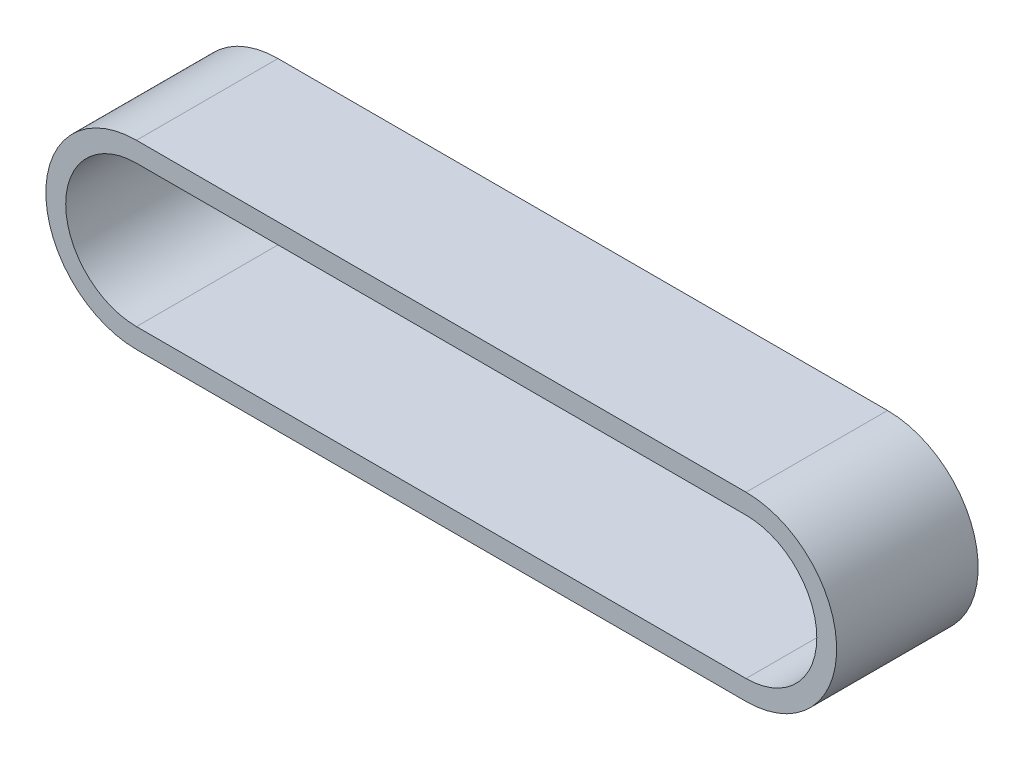
ISO-10303-21;
HEADER;
FILE_DESCRIPTION(('STEP AP214'),'2;1');
FILE_NAME('part.step','',(''),(''),'','','');
FILE_SCHEMA(('AUTOMOTIVE_DESIGN { 1 0 10303 214 1 1 1 1 }'));
ENDSEC;
DATA;
#1=APPLICATION_CONTEXT('core data for automotive mechanical design processes');
#2=APPLICATION_PROTOCOL_DEFINITION('international standard','automotive_design',2000,#1);
#3=PRODUCT_CONTEXT('',#1,'mechanical');
#4=PRODUCT('Part','Part','',(#3));
#5=PRODUCT_RELATED_PRODUCT_CATEGORY('part','',(#4));
#6=PRODUCT_DEFINITION_FORMATION('','',#4);
#7=PRODUCT_DEFINITION_CONTEXT('part definition',#1,'design');
#8=PRODUCT_DEFINITION('design','',#6,#7);
#9=PRODUCT_DEFINITION_SHAPE('','',#8);
#10=(LENGTH_UNIT() NAMED_UNIT(*) SI_UNIT(.MILLI.,.METRE.));
#11=(NAMED_UNIT(*) PLANE_ANGLE_UNIT() SI_UNIT($,.RADIAN.));
#12=(NAMED_UNIT(*) SI_UNIT($,.STERADIAN.) SOLID_ANGLE_UNIT());
#13=UNCERTAINTY_MEASURE_WITH_UNIT(LENGTH_MEASURE(1.E-05),#10,'distance_accuracy_value','');
#14=(GEOMETRIC_REPRESENTATION_CONTEXT(3) GLOBAL_UNCERTAINTY_ASSIGNED_CONTEXT((#13)) GLOBAL_UNIT_ASSIGNED_CONTEXT((#10,
#11,#12)) REPRESENTATION_CONTEXT('',''));
#15=CARTESIAN_POINT('',(0.,0.,0.));
#16=DIRECTION('',(0.,0.,1.));
#17=DIRECTION('',(1.,0.,0.));
#18=AXIS2_PLACEMENT_3D('',#15,#16,#17);
#19=CARTESIAN_POINT('',(107.682833186459,-12.5,25.));
#20=DIRECTION('',(0.,0.,-1.));
#21=DIRECTION('',(-1.,0.,0.));
#22=AXIS2_PLACEMENT_3D('',#19,#20,#21);
#23=PLANE('',#22);
#24=CARTESIAN_POINT('',(107.682833186459,-12.5,25.));
#25=DIRECTION('',(0.,0.,1.));
#26=DIRECTION('',(-1.,0.,0.));
#27=AXIS2_PLACEMENT_3D('',#24,#25,#26);
#28=CIRCLE('',#27,16.0090236418639);
#29=CARTESIAN_POINT('',(107.682833186459,-28.5090236418639,25.));
#30=VERTEX_POINT('',#29);
#31=CARTESIAN_POINT('',(107.682833186459,3.50902364186389,25.));
#32=VERTEX_POINT('',#31);
#33=EDGE_CURVE('E153',#30,#32,#28,.T.);
#34=ORIENTED_EDGE('',*,*,#33,.T.);
#35=DIRECTION('',(-1.,0.,0.));
#36=VECTOR('',#35,1.);
#37=CARTESIAN_POINT('',(0.,3.50902364186389,25.));
#38=LINE('',#37,#36);
#39=CARTESIAN_POINT('',(0.,3.50902364186389,25.));
#40=VERTEX_POINT('',#39);
#41=EDGE_CURVE('E157',#32,#40,#38,.T.);
#42=ORIENTED_EDGE('',*,*,#41,.T.);
#43=CARTESIAN_POINT('',(0.,-12.5,25.));
#44=DIRECTION('',(0.,0.,1.));
#45=DIRECTION('',(1.,0.,0.));
#46=AXIS2_PLACEMENT_3D('',#43,#44,#45);
#47=CIRCLE('',#46,16.0090236418639);
#48=CARTESIAN_POINT('',(0.,-28.5090236418639,25.));
#49=VERTEX_POINT('',#48);
#50=EDGE_CURVE('E161',#40,#49,#47,.T.);
#51=ORIENTED_EDGE('',*,*,#50,.T.);
#52=DIRECTION('',(1.,0.,0.));
#53=VECTOR('',#52,1.);
#54=CARTESIAN_POINT('',(0.,-28.5090236418639,25.));
#55=LINE('',#54,#53);
#56=EDGE_CURVE('E164',#49,#30,#55,.T.);
#57=ORIENTED_EDGE('',*,*,#56,.T.);
#58=EDGE_LOOP('',(#34,#42,#51,#57));
#59=FACE_BOUND('',#58,.T.);
#60=CARTESIAN_POINT('',(0.,-12.5,25.));
#61=DIRECTION('',(0.,0.,1.));
#62=DIRECTION('',(1.,0.,0.));
#63=AXIS2_PLACEMENT_3D('',#60,#61,#62);
#64=CIRCLE('',#63,12.5);
#65=CARTESIAN_POINT('',(0.,0.,25.));
#66=VERTEX_POINT('',#65);
#67=CARTESIAN_POINT('',(0.,-25.,25.));
#68=VERTEX_POINT('',#67);
#69=EDGE_CURVE('E105',#66,#68,#64,.T.);
#70=ORIENTED_EDGE('',*,*,#69,.F.);
#71=DIRECTION('',(-1.,0.,0.));
#72=VECTOR('',#71,1.);
#73=CARTESIAN_POINT('',(0.,0.,25.));
#74=LINE('',#73,#72);
#75=CARTESIAN_POINT('',(107.682833186459,0.,25.));
#76=VERTEX_POINT('',#75);
#77=EDGE_CURVE('E131',#76,#66,#74,.T.);
#78=ORIENTED_EDGE('',*,*,#77,.F.);
#79=CARTESIAN_POINT('',(107.682833186459,-12.5,25.));
#80=DIRECTION('',(0.,0.,1.));
#81=DIRECTION('',(-1.,0.,0.));
#82=AXIS2_PLACEMENT_3D('',#79,#80,#81);
#83=CIRCLE('',#82,12.5);
#84=CARTESIAN_POINT('',(107.682833186459,-25.,25.));
#85=VERTEX_POINT('',#84);
#86=EDGE_CURVE('E127',#85,#76,#83,.T.);
#87=ORIENTED_EDGE('',*,*,#86,.F.);
#88=DIRECTION('',(1.,0.,0.));
#89=VECTOR('',#88,1.);
#90=CARTESIAN_POINT('',(0.,-25.,25.));
#91=LINE('',#90,#89);
#92=EDGE_CURVE('E114',#68,#85,#91,.T.);
#93=ORIENTED_EDGE('',*,*,#92,.F.);
#94=EDGE_LOOP('',(#70,#78,#87,#93));
#95=FACE_BOUND('',#94,.T.);
#96=ADVANCED_FACE('F39',(#59,#95),#23,.F.);
#97=CARTESIAN_POINT('',(107.682833186459,-12.5,0.));
#98=DIRECTION('',(0.,0.,-1.));
#99=DIRECTION('',(-1.,0.,0.));
#100=AXIS2_PLACEMENT_3D('',#97,#98,#99);
#101=PLANE('',#100);
#102=CARTESIAN_POINT('',(107.682833186459,-12.5,0.));
#103=DIRECTION('',(0.,0.,1.));
#104=DIRECTION('',(-1.,0.,0.));
#105=AXIS2_PLACEMENT_3D('',#102,#103,#104);
#106=CIRCLE('',#105,16.0090236418639);
#107=CARTESIAN_POINT('',(107.682833186459,-28.5090236418639,0.));
#108=VERTEX_POINT('',#107);
#109=CARTESIAN_POINT('',(107.682833186459,3.50902364186389,0.));
#110=VERTEX_POINT('',#109);
#111=EDGE_CURVE('E123',#108,#110,#106,.T.);
#112=ORIENTED_EDGE('',*,*,#111,.F.);
#113=DIRECTION('',(1.,0.,0.));
#114=VECTOR('',#113,1.);
#115=CARTESIAN_POINT('',(0.,-28.5090236418639,0.));
#116=LINE('',#115,#114);
#117=CARTESIAN_POINT('',(0.,-28.5090236418639,0.));
#118=VERTEX_POINT('',#117);
#119=EDGE_CURVE('E158',#118,#108,#116,.T.);
#120=ORIENTED_EDGE('',*,*,#119,.F.);
#121=CARTESIAN_POINT('',(0.,-12.5,0.));
#122=DIRECTION('',(0.,0.,1.));
#123=DIRECTION('',(1.,0.,0.));
#124=AXIS2_PLACEMENT_3D('',#121,#122,#123);
#125=CIRCLE('',#124,16.0090236418639);
#126=CARTESIAN_POINT('',(0.,3.50902364186389,0.));
#127=VERTEX_POINT('',#126);
#128=EDGE_CURVE('E174',#127,#118,#125,.T.);
#129=ORIENTED_EDGE('',*,*,#128,.F.);
#130=DIRECTION('',(-1.,0.,0.));
#131=VECTOR('',#130,1.);
#132=CARTESIAN_POINT('',(0.,3.50902364186389,0.));
#133=LINE('',#132,#131);
#134=EDGE_CURVE('E171',#110,#127,#133,.T.);
#135=ORIENTED_EDGE('',*,*,#134,.F.);
#136=EDGE_LOOP('',(#112,#120,#129,#135));
#137=FACE_BOUND('',#136,.T.);
#138=DIRECTION('',(-1.,0.,0.));
#139=VECTOR('',#138,1.);
#140=CARTESIAN_POINT('',(0.,0.,0.));
#141=LINE('',#140,#139);
#142=CARTESIAN_POINT('',(107.682833186459,0.,0.));
#143=VERTEX_POINT('',#142);
#144=CARTESIAN_POINT('',(0.,0.,0.));
#145=VERTEX_POINT('',#144);
#146=EDGE_CURVE('E115',#143,#145,#141,.T.);
#147=ORIENTED_EDGE('',*,*,#146,.T.);
#148=CARTESIAN_POINT('',(0.,-12.5,0.));
#149=DIRECTION('',(0.,0.,1.));
#150=DIRECTION('',(1.,0.,0.));
#151=AXIS2_PLACEMENT_3D('',#148,#149,#150);
#152=CIRCLE('',#151,12.5);
#153=CARTESIAN_POINT('',(0.,-25.,0.));
#154=VERTEX_POINT('',#153);
#155=EDGE_CURVE('E63',#145,#154,#152,.T.);
#156=ORIENTED_EDGE('',*,*,#155,.T.);
#157=DIRECTION('',(1.,0.,0.));
#158=VECTOR('',#157,1.);
#159=CARTESIAN_POINT('',(0.,-25.,0.));
#160=LINE('',#159,#158);
#161=CARTESIAN_POINT('',(107.682833186459,-25.,0.));
#162=VERTEX_POINT('',#161);
#163=EDGE_CURVE('E121',#154,#162,#160,.T.);
#164=ORIENTED_EDGE('',*,*,#163,.T.);
#165=CARTESIAN_POINT('',(107.682833186459,-12.5,0.));
#166=DIRECTION('',(0.,0.,1.));
#167=DIRECTION('',(-1.,0.,0.));
#168=AXIS2_PLACEMENT_3D('',#165,#166,#167);
#169=CIRCLE('',#168,12.5);
#170=EDGE_CURVE('E140',#162,#143,#169,.T.);
#171=ORIENTED_EDGE('',*,*,#170,.T.);
#172=EDGE_LOOP('',(#147,#156,#164,#171));
#173=FACE_BOUND('',#172,.T.);
#174=ADVANCED_FACE('F197',(#137,#173),#101,.T.);
#175=CARTESIAN_POINT('',(107.682833186459,-12.5,25.));
#176=DIRECTION('',(0.,0.,-1.));
#177=DIRECTION('',(-1.,0.,0.));
#178=AXIS2_PLACEMENT_3D('',#175,#176,#177);
#179=CYLINDRICAL_SURFACE('',#178,16.0090236418639);
#180=ORIENTED_EDGE('',*,*,#111,.T.);
#181=DIRECTION('',(0.,0.,-1.));
#182=VECTOR('',#181,1.);
#183=CARTESIAN_POINT('',(107.682833186459,3.50902364186389,25.));
#184=LINE('',#183,#182);
#185=EDGE_CURVE('E11',#32,#110,#184,.T.);
#186=ORIENTED_EDGE('',*,*,#185,.F.);
#187=ORIENTED_EDGE('',*,*,#33,.F.);
#188=DIRECTION('',(0.,0.,-1.));
#189=VECTOR('',#188,1.);
#190=CARTESIAN_POINT('',(107.682833186459,-28.5090236418639,25.));
#191=LINE('',#190,#189);
#192=EDGE_CURVE('E167',#30,#108,#191,.T.);
#193=ORIENTED_EDGE('',*,*,#192,.T.);
#194=EDGE_LOOP('',(#180,#186,#187,#193));
#195=FACE_BOUND('',#194,.T.);
#196=ADVANCED_FACE('F41',(#195),#179,.T.);
#197=CARTESIAN_POINT('',(0.,3.50902364186389,25.));
#198=DIRECTION('',(0.,-1.,0.));
#199=DIRECTION('',(0.,0.,-1.));
#200=AXIS2_PLACEMENT_3D('',#197,#198,#199);
#201=PLANE('',#200);
#202=ORIENTED_EDGE('',*,*,#134,.T.);
#203=DIRECTION('',(0.,0.,-1.));
#204=VECTOR('',#203,1.);
#205=CARTESIAN_POINT('',(0.,3.50902364186389,25.));
#206=LINE('',#205,#204);
#207=EDGE_CURVE('E48',#40,#127,#206,.T.);
#208=ORIENTED_EDGE('',*,*,#207,.F.);
#209=ORIENTED_EDGE('',*,*,#41,.F.);
#210=ORIENTED_EDGE('',*,*,#185,.T.);
#211=EDGE_LOOP('',(#202,#208,#209,#210));
#212=FACE_BOUND('',#211,.T.);
#213=ADVANCED_FACE('F207',(#212),#201,.F.);
#214=CARTESIAN_POINT('',(0.,-12.5,25.));
#215=DIRECTION('',(0.,0.,-1.));
#216=DIRECTION('',(-1.,0.,0.));
#217=AXIS2_PLACEMENT_3D('',#214,#215,#216);
#218=CYLINDRICAL_SURFACE('',#217,16.0090236418639);
#219=ORIENTED_EDGE('',*,*,#128,.T.);
#220=DIRECTION('',(0.,0.,-1.));
#221=VECTOR('',#220,1.);
#222=CARTESIAN_POINT('',(0.,-28.5090236418639,25.));
#223=LINE('',#222,#221);
#224=EDGE_CURVE('E182',#49,#118,#223,.T.);
#225=ORIENTED_EDGE('',*,*,#224,.F.);
#226=ORIENTED_EDGE('',*,*,#50,.F.);
#227=ORIENTED_EDGE('',*,*,#207,.T.);
#228=EDGE_LOOP('',(#219,#225,#226,#227));
#229=FACE_BOUND('',#228,.T.);
#230=ADVANCED_FACE('F191',(#229),#218,.T.);
#231=CARTESIAN_POINT('',(0.,-28.5090236418639,25.));
#232=DIRECTION('',(0.,1.,0.));
#233=DIRECTION('',(0.,0.,1.));
#234=AXIS2_PLACEMENT_3D('',#231,#232,#233);
#235=PLANE('',#234);
#236=ORIENTED_EDGE('',*,*,#119,.T.);
#237=ORIENTED_EDGE('',*,*,#192,.F.);
#238=ORIENTED_EDGE('',*,*,#56,.F.);
#239=ORIENTED_EDGE('',*,*,#224,.T.);
#240=EDGE_LOOP('',(#236,#237,#238,#239));
#241=FACE_BOUND('',#240,.T.);
#242=ADVANCED_FACE('F201',(#241),#235,.F.);
#243=CARTESIAN_POINT('',(0.,-12.5,25.));
#244=DIRECTION('',(0.,0.,-1.));
#245=DIRECTION('',(-1.,0.,0.));
#246=AXIS2_PLACEMENT_3D('',#243,#244,#245);
#247=CYLINDRICAL_SURFACE('',#246,12.5);
#248=ORIENTED_EDGE('',*,*,#155,.F.);
#249=DIRECTION('',(0.,0.,-1.));
#250=VECTOR('',#249,1.);
#251=CARTESIAN_POINT('',(0.,0.,25.));
#252=LINE('',#251,#250);
#253=EDGE_CURVE('E109',#66,#145,#252,.T.);
#254=ORIENTED_EDGE('',*,*,#253,.F.);
#255=ORIENTED_EDGE('',*,*,#69,.T.);
#256=DIRECTION('',(0.,0.,-1.));
#257=VECTOR('',#256,1.);
#258=CARTESIAN_POINT('',(0.,-25.,25.));
#259=LINE('',#258,#257);
#260=EDGE_CURVE('E108',#68,#154,#259,.T.);
#261=ORIENTED_EDGE('',*,*,#260,.T.);
#262=EDGE_LOOP('',(#248,#254,#255,#261));
#263=FACE_BOUND('',#262,.T.);
#264=ADVANCED_FACE('F107',(#263),#247,.F.);
#265=CARTESIAN_POINT('',(0.,-25.,25.));
#266=DIRECTION('',(0.,1.,0.));
#267=DIRECTION('',(0.,0.,1.));
#268=AXIS2_PLACEMENT_3D('',#265,#266,#267);
#269=PLANE('',#268);
#270=ORIENTED_EDGE('',*,*,#163,.F.);
#271=ORIENTED_EDGE('',*,*,#260,.F.);
#272=ORIENTED_EDGE('',*,*,#92,.T.);
#273=DIRECTION('',(0.,0.,-1.));
#274=VECTOR('',#273,1.);
#275=CARTESIAN_POINT('',(107.682833186459,-25.,25.));
#276=LINE('',#275,#274);
#277=EDGE_CURVE('E124',#85,#162,#276,.T.);
#278=ORIENTED_EDGE('',*,*,#277,.T.);
#279=EDGE_LOOP('',(#270,#271,#272,#278));
#280=FACE_BOUND('',#279,.T.);
#281=ADVANCED_FACE('F118',(#280),#269,.T.);
#282=CARTESIAN_POINT('',(107.682833186459,-12.5,25.));
#283=DIRECTION('',(0.,0.,-1.));
#284=DIRECTION('',(-1.,0.,0.));
#285=AXIS2_PLACEMENT_3D('',#282,#283,#284);
#286=CYLINDRICAL_SURFACE('',#285,12.5);
#287=ORIENTED_EDGE('',*,*,#170,.F.);
#288=ORIENTED_EDGE('',*,*,#277,.F.);
#289=ORIENTED_EDGE('',*,*,#86,.T.);
#290=DIRECTION('',(0.,0.,-1.));
#291=VECTOR('',#290,1.);
#292=CARTESIAN_POINT('',(107.682833186459,0.,25.));
#293=LINE('',#292,#291);
#294=EDGE_CURVE('E55',#76,#143,#293,.T.);
#295=ORIENTED_EDGE('',*,*,#294,.T.);
#296=EDGE_LOOP('',(#287,#288,#289,#295));
#297=FACE_BOUND('',#296,.T.);
#298=ADVANCED_FACE('F230',(#297),#286,.F.);
#299=CARTESIAN_POINT('',(0.,0.,25.));
#300=DIRECTION('',(0.,-1.,0.));
#301=DIRECTION('',(0.,0.,-1.));
#302=AXIS2_PLACEMENT_3D('',#299,#300,#301);
#303=PLANE('',#302);
#304=ORIENTED_EDGE('',*,*,#146,.F.);
#305=ORIENTED_EDGE('',*,*,#294,.F.);
#306=ORIENTED_EDGE('',*,*,#77,.T.);
#307=ORIENTED_EDGE('',*,*,#253,.T.);
#308=EDGE_LOOP('',(#304,#305,#306,#307));
#309=FACE_BOUND('',#308,.T.);
#310=ADVANCED_FACE('F234',(#309),#303,.T.);
#311=CLOSED_SHELL('',(#96,#174,#196,#213,#230,#242,#264,#281,#298,#310));
#312=MANIFOLD_SOLID_BREP('B2',#311);
#313=ADVANCED_BREP_SHAPE_REPRESENTATION('',(#18,#312),#14);
#314=SHAPE_DEFINITION_REPRESENTATION(#9,#313);
ENDSEC;
END-ISO-10303-21;
